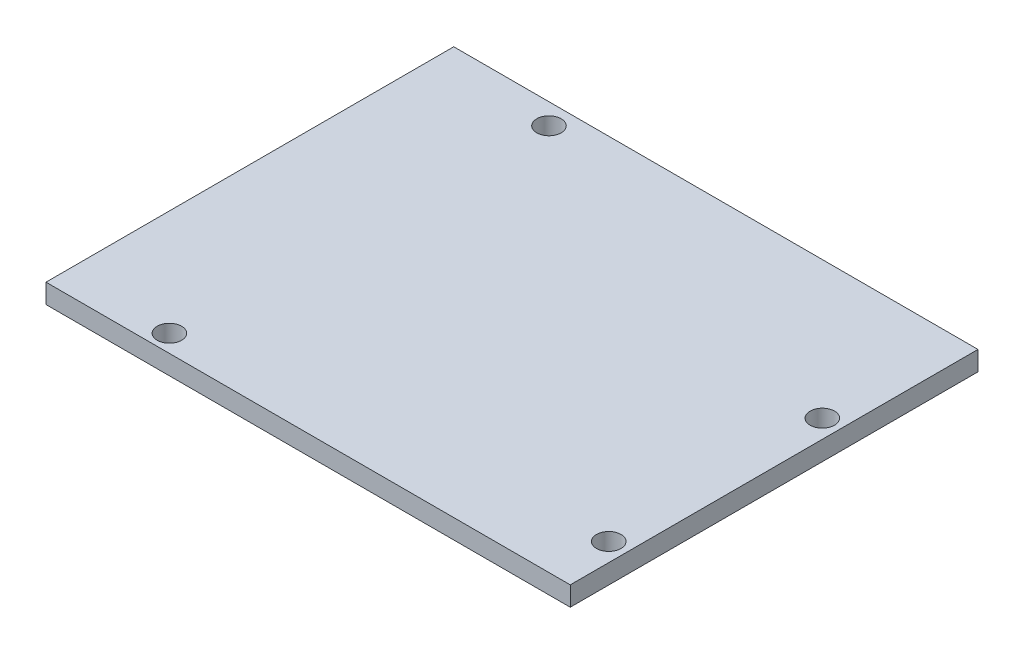
ISO-10303-21;
HEADER;
FILE_DESCRIPTION(('STEP AP214'),'2;1');
FILE_NAME('part.step','',(''),(''),'','','');
FILE_SCHEMA(('AUTOMOTIVE_DESIGN { 1 0 10303 214 1 1 1 1 }'));
ENDSEC;
DATA;
#1=APPLICATION_CONTEXT('core data for automotive mechanical design processes');
#2=APPLICATION_PROTOCOL_DEFINITION('international standard','automotive_design',2000,#1);
#3=PRODUCT_CONTEXT('',#1,'mechanical');
#4=PRODUCT('Part','Part','',(#3));
#5=PRODUCT_RELATED_PRODUCT_CATEGORY('part','',(#4));
#6=PRODUCT_DEFINITION_FORMATION('','',#4);
#7=PRODUCT_DEFINITION_CONTEXT('part definition',#1,'design');
#8=PRODUCT_DEFINITION('design','',#6,#7);
#9=PRODUCT_DEFINITION_SHAPE('','',#8);
#10=(LENGTH_UNIT() NAMED_UNIT(*) SI_UNIT(.MILLI.,.METRE.));
#11=(NAMED_UNIT(*) PLANE_ANGLE_UNIT() SI_UNIT($,.RADIAN.));
#12=(NAMED_UNIT(*) SI_UNIT($,.STERADIAN.) SOLID_ANGLE_UNIT());
#13=UNCERTAINTY_MEASURE_WITH_UNIT(LENGTH_MEASURE(1.E-05),#10,'distance_accuracy_value','');
#14=(GEOMETRIC_REPRESENTATION_CONTEXT(3) GLOBAL_UNCERTAINTY_ASSIGNED_CONTEXT((#13)) GLOBAL_UNIT_ASSIGNED_CONTEXT((#10,
#11,#12)) REPRESENTATION_CONTEXT('',''));
#15=CARTESIAN_POINT('',(0.,0.,0.));
#16=DIRECTION('',(0.,0.,1.));
#17=DIRECTION('',(1.,0.,0.));
#18=AXIS2_PLACEMENT_3D('',#15,#16,#17);
#19=CARTESIAN_POINT('',(-36.0597006946585,2.54,-25.7203976000169));
#20=DIRECTION('',(1.,0.,0.));
#21=DIRECTION('',(0.,0.,-1.));
#22=AXIS2_PLACEMENT_3D('',#19,#20,#21);
#23=PLANE('',#22);
#24=DIRECTION('',(0.,0.,1.));
#25=VECTOR('',#24,1.);
#26=CARTESIAN_POINT('',(-36.0597006946585,0.,-25.7203976000169));
#27=LINE('',#26,#25);
#28=CARTESIAN_POINT('',(-36.0597006946585,0.,-25.7203976000169));
#29=VERTEX_POINT('',#28);
#30=CARTESIAN_POINT('',(-36.0597006946585,0.,27.6196023999831));
#31=VERTEX_POINT('',#30);
#32=EDGE_CURVE('E99',#29,#31,#27,.T.);
#33=ORIENTED_EDGE('',*,*,#32,.T.);
#34=DIRECTION('',(0.,-1.,0.));
#35=VECTOR('',#34,1.);
#36=CARTESIAN_POINT('',(-36.0597006946585,2.54,27.6196023999831));
#37=LINE('',#36,#35);
#38=CARTESIAN_POINT('',(-36.0597006946585,2.54,27.6196023999831));
#39=VERTEX_POINT('',#38);
#40=EDGE_CURVE('E11',#39,#31,#37,.T.);
#41=ORIENTED_EDGE('',*,*,#40,.F.);
#42=DIRECTION('',(0.,0.,1.));
#43=VECTOR('',#42,1.);
#44=CARTESIAN_POINT('',(-36.0597006946585,2.54,-25.7203976000169));
#45=LINE('',#44,#43);
#46=CARTESIAN_POINT('',(-36.0597006946585,2.54,-25.7203976000169));
#47=VERTEX_POINT('',#46);
#48=EDGE_CURVE('E86',#47,#39,#45,.T.);
#49=ORIENTED_EDGE('',*,*,#48,.F.);
#50=DIRECTION('',(0.,-1.,0.));
#51=VECTOR('',#50,1.);
#52=CARTESIAN_POINT('',(-36.0597006946585,2.54,-25.7203976000169));
#53=LINE('',#52,#51);
#54=EDGE_CURVE('E95',#47,#29,#53,.T.);
#55=ORIENTED_EDGE('',*,*,#54,.T.);
#56=EDGE_LOOP('',(#33,#41,#49,#55));
#57=FACE_BOUND('',#56,.T.);
#58=ADVANCED_FACE('F33',(#57),#23,.F.);
#59=CARTESIAN_POINT('',(-36.0597006946585,2.54,27.6196023999831));
#60=DIRECTION('',(0.,0.,-1.));
#61=DIRECTION('',(-1.,0.,0.));
#62=AXIS2_PLACEMENT_3D('',#59,#60,#61);
#63=PLANE('',#62);
#64=DIRECTION('',(1.,0.,0.));
#65=VECTOR('',#64,1.);
#66=CARTESIAN_POINT('',(-36.0597006946585,0.,27.6196023999831));
#67=LINE('',#66,#65);
#68=CARTESIAN_POINT('',(32.5202993053415,0.,27.6196023999831));
#69=VERTEX_POINT('',#68);
#70=EDGE_CURVE('E90',#31,#69,#67,.T.);
#71=ORIENTED_EDGE('',*,*,#70,.T.);
#72=DIRECTION('',(0.,-1.,0.));
#73=VECTOR('',#72,1.);
#74=CARTESIAN_POINT('',(32.5202993053415,2.54,27.6196023999831));
#75=LINE('',#74,#73);
#76=CARTESIAN_POINT('',(32.5202993053415,2.54,27.6196023999831));
#77=VERTEX_POINT('',#76);
#78=EDGE_CURVE('E42',#77,#69,#75,.T.);
#79=ORIENTED_EDGE('',*,*,#78,.F.);
#80=DIRECTION('',(1.,0.,0.));
#81=VECTOR('',#80,1.);
#82=CARTESIAN_POINT('',(-36.0597006946585,2.54,27.6196023999831));
#83=LINE('',#82,#81);
#84=EDGE_CURVE('E81',#39,#77,#83,.T.);
#85=ORIENTED_EDGE('',*,*,#84,.F.);
#86=ORIENTED_EDGE('',*,*,#40,.T.);
#87=EDGE_LOOP('',(#71,#79,#85,#86));
#88=FACE_BOUND('',#87,.T.);
#89=ADVANCED_FACE('F89',(#88),#63,.F.);
#90=CARTESIAN_POINT('',(32.5202993053415,2.54,-25.7203976000169));
#91=DIRECTION('',(-1.,0.,0.));
#92=DIRECTION('',(0.,0.,1.));
#93=AXIS2_PLACEMENT_3D('',#90,#91,#92);
#94=PLANE('',#93);
#95=DIRECTION('',(0.,0.,-1.));
#96=VECTOR('',#95,1.);
#97=CARTESIAN_POINT('',(32.5202993053415,0.,-25.7203976000169));
#98=LINE('',#97,#96);
#99=CARTESIAN_POINT('',(32.5202993053415,0.,-25.7203976000169));
#100=VERTEX_POINT('',#99);
#101=EDGE_CURVE('E68',#69,#100,#98,.T.);
#102=ORIENTED_EDGE('',*,*,#101,.T.);
#103=DIRECTION('',(0.,-1.,0.));
#104=VECTOR('',#103,1.);
#105=CARTESIAN_POINT('',(32.5202993053415,2.54,-25.7203976000169));
#106=LINE('',#105,#104);
#107=CARTESIAN_POINT('',(32.5202993053415,2.54,-25.7203976000169));
#108=VERTEX_POINT('',#107);
#109=EDGE_CURVE('E91',#108,#100,#106,.T.);
#110=ORIENTED_EDGE('',*,*,#109,.F.);
#111=DIRECTION('',(0.,0.,-1.));
#112=VECTOR('',#111,1.);
#113=CARTESIAN_POINT('',(32.5202993053415,2.54,-25.7203976000169));
#114=LINE('',#113,#112);
#115=EDGE_CURVE('E84',#77,#108,#114,.T.);
#116=ORIENTED_EDGE('',*,*,#115,.F.);
#117=ORIENTED_EDGE('',*,*,#78,.T.);
#118=EDGE_LOOP('',(#102,#110,#116,#117));
#119=FACE_BOUND('',#118,.T.);
#120=ADVANCED_FACE('F93',(#119),#94,.F.);
#121=CARTESIAN_POINT('',(-36.0597006946585,2.54,-25.7203976000169));
#122=DIRECTION('',(0.,0.,1.));
#123=DIRECTION('',(1.,0.,0.));
#124=AXIS2_PLACEMENT_3D('',#121,#122,#123);
#125=PLANE('',#124);
#126=DIRECTION('',(-1.,0.,0.));
#127=VECTOR('',#126,1.);
#128=CARTESIAN_POINT('',(-36.0597006946585,0.,-25.7203976000169));
#129=LINE('',#128,#127);
#130=EDGE_CURVE('E74',#100,#29,#129,.T.);
#131=ORIENTED_EDGE('',*,*,#130,.T.);
#132=ORIENTED_EDGE('',*,*,#54,.F.);
#133=DIRECTION('',(-1.,0.,0.));
#134=VECTOR('',#133,1.);
#135=CARTESIAN_POINT('',(-36.0597006946585,2.54,-25.7203976000169));
#136=LINE('',#135,#134);
#137=EDGE_CURVE('E51',#108,#47,#136,.T.);
#138=ORIENTED_EDGE('',*,*,#137,.F.);
#139=ORIENTED_EDGE('',*,*,#109,.T.);
#140=EDGE_LOOP('',(#131,#132,#138,#139));
#141=FACE_BOUND('',#140,.T.);
#142=ADVANCED_FACE('F137',(#141),#125,.F.);
#143=CARTESIAN_POINT('',(-36.0597006946585,2.54,27.6196023999831));
#144=DIRECTION('',(0.,1.,0.));
#145=DIRECTION('',(0.,0.,1.));
#146=AXIS2_PLACEMENT_3D('',#143,#144,#145);
#147=PLANE('',#146);
#148=CARTESIAN_POINT('',(30.1253301339138,2.54,-7.75237547650675));
#149=DIRECTION('',(0.,1.,0.));
#150=DIRECTION('',(0.,0.,1.));
#151=AXIS2_PLACEMENT_3D('',#148,#149,#150);
#152=CIRCLE('',#151,1.59999999999999);
#153=CARTESIAN_POINT('',(30.1253301339138,2.54,-6.15237547650676));
#154=VERTEX_POINT('',#153);
#155=EDGE_CURVE('E126',#154,#154,#152,.T.);
#156=ORIENTED_EDGE('',*,*,#155,.F.);
#157=EDGE_LOOP('',(#156));
#158=FACE_BOUND('',#157,.T.);
#159=CARTESIAN_POINT('',(30.1253301339138,2.54,20.1876245234932));
#160=DIRECTION('',(0.,1.,0.));
#161=DIRECTION('',(0.,0.,1.));
#162=AXIS2_PLACEMENT_3D('',#159,#160,#161);
#163=CIRCLE('',#162,1.59999999999999);
#164=CARTESIAN_POINT('',(30.1253301339138,2.54,21.7876245234932));
#165=VERTEX_POINT('',#164);
#166=EDGE_CURVE('E116',#165,#165,#163,.T.);
#167=ORIENTED_EDGE('',*,*,#166,.F.);
#168=EDGE_LOOP('',(#167));
#169=FACE_BOUND('',#168,.T.);
#170=CARTESIAN_POINT('',(-22.1986698660862,2.54,25.3353579034932));
#171=DIRECTION('',(0.,1.,0.));
#172=DIRECTION('',(0.,0.,1.));
#173=AXIS2_PLACEMENT_3D('',#170,#171,#172);
#174=CIRCLE('',#173,1.59999999999999);
#175=CARTESIAN_POINT('',(-22.1986698660862,2.54,26.9353579034932));
#176=VERTEX_POINT('',#175);
#177=EDGE_CURVE('E113',#176,#176,#174,.T.);
#178=ORIENTED_EDGE('',*,*,#177,.F.);
#179=EDGE_LOOP('',(#178));
#180=FACE_BOUND('',#179,.T.);
#181=CARTESIAN_POINT('',(-20.8746698660862,2.54,-22.9923754765068));
#182=DIRECTION('',(0.,1.,0.));
#183=DIRECTION('',(0.,0.,1.));
#184=AXIS2_PLACEMENT_3D('',#181,#182,#183);
#185=CIRCLE('',#184,1.59999999999999);
#186=CARTESIAN_POINT('',(-20.8746698660862,2.54,-21.3923754765068));
#187=VERTEX_POINT('',#186);
#188=EDGE_CURVE('E110',#187,#187,#185,.T.);
#189=ORIENTED_EDGE('',*,*,#188,.F.);
#190=EDGE_LOOP('',(#189));
#191=FACE_BOUND('',#190,.T.);
#192=ORIENTED_EDGE('',*,*,#48,.T.);
#193=ORIENTED_EDGE('',*,*,#84,.T.);
#194=ORIENTED_EDGE('',*,*,#115,.T.);
#195=ORIENTED_EDGE('',*,*,#137,.T.);
#196=EDGE_LOOP('',(#192,#193,#194,#195));
#197=FACE_BOUND('',#196,.T.);
#198=ADVANCED_FACE('F82',(#158,#169,#180,#191,#197),#147,.T.);
#199=CARTESIAN_POINT('',(-36.0597006946585,0.,27.6196023999831));
#200=DIRECTION('',(0.,1.,0.));
#201=DIRECTION('',(0.,0.,1.));
#202=AXIS2_PLACEMENT_3D('',#199,#200,#201);
#203=PLANE('',#202);
#204=CARTESIAN_POINT('',(30.1253301339138,0.,-7.75237547650675));
#205=DIRECTION('',(0.,1.,0.));
#206=DIRECTION('',(0.,0.,1.));
#207=AXIS2_PLACEMENT_3D('',#204,#205,#206);
#208=CIRCLE('',#207,1.59999999999999);
#209=CARTESIAN_POINT('',(30.1253301339138,0.,-6.15237547650676));
#210=VERTEX_POINT('',#209);
#211=EDGE_CURVE('E36',#210,#210,#208,.T.);
#212=ORIENTED_EDGE('',*,*,#211,.T.);
#213=EDGE_LOOP('',(#212));
#214=FACE_BOUND('',#213,.T.);
#215=CARTESIAN_POINT('',(30.1253301339138,0.,20.1876245234932));
#216=DIRECTION('',(0.,1.,0.));
#217=DIRECTION('',(0.,0.,1.));
#218=AXIS2_PLACEMENT_3D('',#215,#216,#217);
#219=CIRCLE('',#218,1.59999999999999);
#220=CARTESIAN_POINT('',(30.1253301339138,0.,21.7876245234932));
#221=VERTEX_POINT('',#220);
#222=EDGE_CURVE('E114',#221,#221,#219,.T.);
#223=ORIENTED_EDGE('',*,*,#222,.T.);
#224=EDGE_LOOP('',(#223));
#225=FACE_BOUND('',#224,.T.);
#226=CARTESIAN_POINT('',(-22.1986698660862,0.,25.3353579034932));
#227=DIRECTION('',(0.,1.,0.));
#228=DIRECTION('',(0.,0.,1.));
#229=AXIS2_PLACEMENT_3D('',#226,#227,#228);
#230=CIRCLE('',#229,1.59999999999999);
#231=CARTESIAN_POINT('',(-22.1986698660862,0.,26.9353579034932));
#232=VERTEX_POINT('',#231);
#233=EDGE_CURVE('E111',#232,#232,#230,.T.);
#234=ORIENTED_EDGE('',*,*,#233,.T.);
#235=EDGE_LOOP('',(#234));
#236=FACE_BOUND('',#235,.T.);
#237=CARTESIAN_POINT('',(-20.8746698660862,0.,-22.9923754765068));
#238=DIRECTION('',(0.,1.,0.));
#239=DIRECTION('',(0.,0.,1.));
#240=AXIS2_PLACEMENT_3D('',#237,#238,#239);
#241=CIRCLE('',#240,1.59999999999999);
#242=CARTESIAN_POINT('',(-20.8746698660862,0.,-21.3923754765068));
#243=VERTEX_POINT('',#242);
#244=EDGE_CURVE('E102',#243,#243,#241,.T.);
#245=ORIENTED_EDGE('',*,*,#244,.T.);
#246=EDGE_LOOP('',(#245));
#247=FACE_BOUND('',#246,.T.);
#248=ORIENTED_EDGE('',*,*,#32,.F.);
#249=ORIENTED_EDGE('',*,*,#130,.F.);
#250=ORIENTED_EDGE('',*,*,#101,.F.);
#251=ORIENTED_EDGE('',*,*,#70,.F.);
#252=EDGE_LOOP('',(#248,#249,#250,#251));
#253=FACE_BOUND('',#252,.T.);
#254=ADVANCED_FACE('F136',(#214,#225,#236,#247,#253),#203,.F.);
#255=CARTESIAN_POINT('',(-20.8746698660862,2.54,-22.9923754765068));
#256=DIRECTION('',(0.,1.,0.));
#257=DIRECTION('',(0.,0.,1.));
#258=AXIS2_PLACEMENT_3D('',#255,#256,#257);
#259=CYLINDRICAL_SURFACE('',#258,1.59999999999999);
#260=ORIENTED_EDGE('',*,*,#188,.T.);
#261=EDGE_LOOP('',(#260));
#262=FACE_BOUND('',#261,.T.);
#263=ORIENTED_EDGE('',*,*,#244,.F.);
#264=EDGE_LOOP('',(#263));
#265=FACE_BOUND('',#264,.T.);
#266=ADVANCED_FACE('F132',(#262,#265),#259,.F.);
#267=CARTESIAN_POINT('',(-22.1986698660862,2.54,25.3353579034932));
#268=DIRECTION('',(0.,1.,0.));
#269=DIRECTION('',(0.,0.,1.));
#270=AXIS2_PLACEMENT_3D('',#267,#268,#269);
#271=CYLINDRICAL_SURFACE('',#270,1.59999999999999);
#272=ORIENTED_EDGE('',*,*,#177,.T.);
#273=EDGE_LOOP('',(#272));
#274=FACE_BOUND('',#273,.T.);
#275=ORIENTED_EDGE('',*,*,#233,.F.);
#276=EDGE_LOOP('',(#275));
#277=FACE_BOUND('',#276,.T.);
#278=ADVANCED_FACE('F186',(#274,#277),#271,.F.);
#279=CARTESIAN_POINT('',(30.1253301339138,2.54,20.1876245234932));
#280=DIRECTION('',(0.,1.,0.));
#281=DIRECTION('',(0.,0.,1.));
#282=AXIS2_PLACEMENT_3D('',#279,#280,#281);
#283=CYLINDRICAL_SURFACE('',#282,1.59999999999999);
#284=ORIENTED_EDGE('',*,*,#166,.T.);
#285=EDGE_LOOP('',(#284));
#286=FACE_BOUND('',#285,.T.);
#287=ORIENTED_EDGE('',*,*,#222,.F.);
#288=EDGE_LOOP('',(#287));
#289=FACE_BOUND('',#288,.T.);
#290=ADVANCED_FACE('F194',(#286,#289),#283,.F.);
#291=CARTESIAN_POINT('',(30.1253301339138,2.54,-7.75237547650675));
#292=DIRECTION('',(0.,1.,0.));
#293=DIRECTION('',(0.,0.,1.));
#294=AXIS2_PLACEMENT_3D('',#291,#292,#293);
#295=CYLINDRICAL_SURFACE('',#294,1.59999999999999);
#296=ORIENTED_EDGE('',*,*,#155,.T.);
#297=EDGE_LOOP('',(#296));
#298=FACE_BOUND('',#297,.T.);
#299=ORIENTED_EDGE('',*,*,#211,.F.);
#300=EDGE_LOOP('',(#299));
#301=FACE_BOUND('',#300,.T.);
#302=ADVANCED_FACE('F204',(#298,#301),#295,.F.);
#303=CLOSED_SHELL('',(#58,#89,#120,#142,#198,#254,#266,#278,#290,#302));
#304=MANIFOLD_SOLID_BREP('B2',#303);
#305=ADVANCED_BREP_SHAPE_REPRESENTATION('',(#18,#304),#14);
#306=SHAPE_DEFINITION_REPRESENTATION(#9,#305);
ENDSEC;
END-ISO-10303-21;
